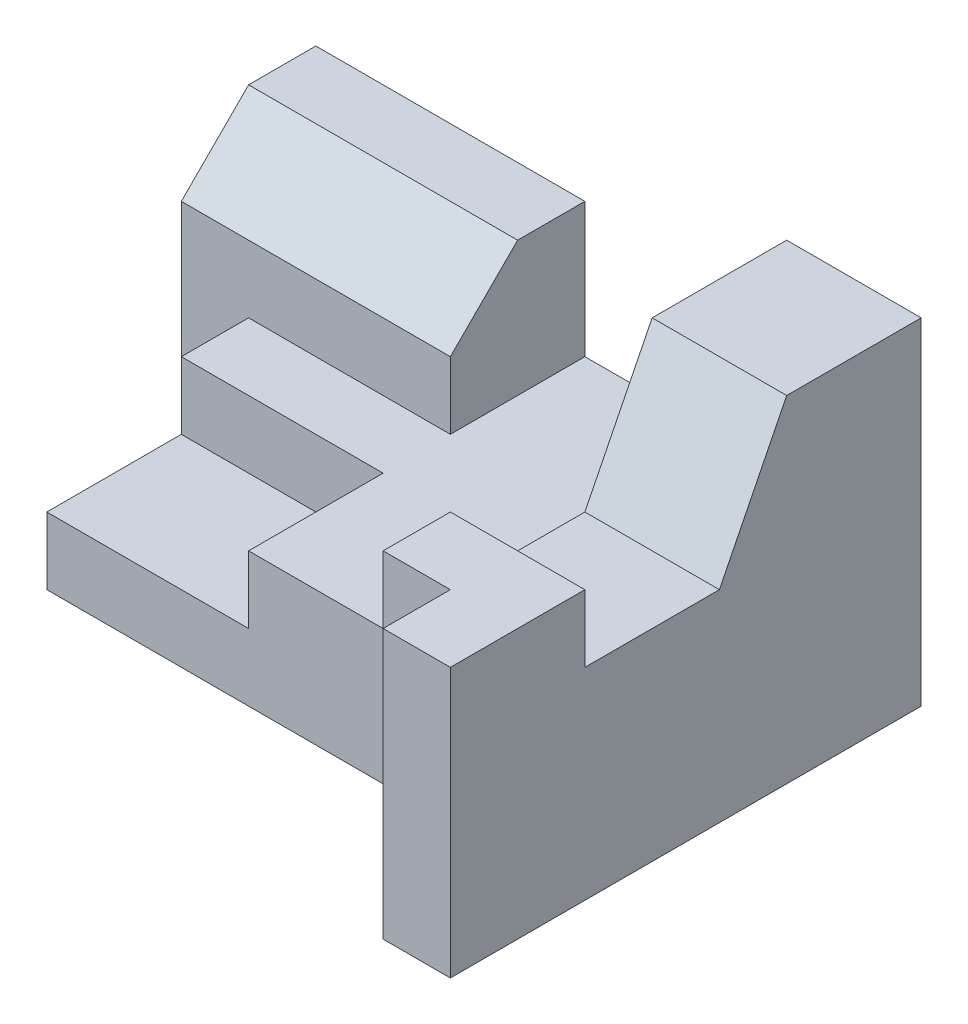
ISO-10303-21;
HEADER;
FILE_DESCRIPTION(('STEP AP214'),'2;1');
FILE_NAME('part.step','',(''),(''),'','','');
FILE_SCHEMA(('AUTOMOTIVE_DESIGN { 1 0 10303 214 1 1 1 1 }'));
ENDSEC;
DATA;
#1=APPLICATION_CONTEXT('core data for automotive mechanical design processes');
#2=APPLICATION_PROTOCOL_DEFINITION('international standard','automotive_design',2000,#1);
#3=PRODUCT_CONTEXT('',#1,'mechanical');
#4=PRODUCT('Part','Part','',(#3));
#5=PRODUCT_RELATED_PRODUCT_CATEGORY('part','',(#4));
#6=PRODUCT_DEFINITION_FORMATION('','',#4);
#7=PRODUCT_DEFINITION_CONTEXT('part definition',#1,'design');
#8=PRODUCT_DEFINITION('design','',#6,#7);
#9=PRODUCT_DEFINITION_SHAPE('','',#8);
#10=(LENGTH_UNIT() NAMED_UNIT(*) SI_UNIT(.MILLI.,.METRE.));
#11=(NAMED_UNIT(*) PLANE_ANGLE_UNIT() SI_UNIT($,.RADIAN.));
#12=(NAMED_UNIT(*) SI_UNIT($,.STERADIAN.) SOLID_ANGLE_UNIT());
#13=UNCERTAINTY_MEASURE_WITH_UNIT(LENGTH_MEASURE(1.E-05),#10,'distance_accuracy_value','');
#14=(GEOMETRIC_REPRESENTATION_CONTEXT(3) GLOBAL_UNCERTAINTY_ASSIGNED_CONTEXT((#13)) GLOBAL_UNIT_ASSIGNED_CONTEXT((#10,
#11,#12)) REPRESENTATION_CONTEXT('',''));
#15=CARTESIAN_POINT('',(0.,0.,0.));
#16=DIRECTION('',(0.,0.,1.));
#17=DIRECTION('',(1.,0.,0.));
#18=AXIS2_PLACEMENT_3D('',#15,#16,#17);
#19=CARTESIAN_POINT('',(-3.,2.,2.5));
#20=DIRECTION('',(1.,0.,0.));
#21=DIRECTION('',(0.,0.,-1.));
#22=AXIS2_PLACEMENT_3D('',#19,#20,#21);
#23=PLANE('',#22);
#24=DIRECTION('',(0.,0.,1.));
#25=VECTOR('',#24,1.);
#26=CARTESIAN_POINT('',(-3.,1.,2.5));
#27=LINE('',#26,#25);
#28=CARTESIAN_POINT('',(-3.,1.,0.5));
#29=VERTEX_POINT('',#28);
#30=CARTESIAN_POINT('',(-3.,1.,2.5));
#31=VERTEX_POINT('',#30);
#32=EDGE_CURVE('E48',#29,#31,#27,.T.);
#33=ORIENTED_EDGE('',*,*,#32,.F.);
#34=DIRECTION('',(0.,1.,0.));
#35=VECTOR('',#34,1.);
#36=CARTESIAN_POINT('',(-3.,1.,0.5));
#37=LINE('',#36,#35);
#38=CARTESIAN_POINT('',(-3.,2.,0.5));
#39=VERTEX_POINT('',#38);
#40=EDGE_CURVE('E198',#29,#39,#37,.T.);
#41=ORIENTED_EDGE('',*,*,#40,.T.);
#42=DIRECTION('',(0.,0.,1.));
#43=VECTOR('',#42,1.);
#44=CARTESIAN_POINT('',(-3.,2.,2.5));
#45=LINE('',#44,#43);
#46=CARTESIAN_POINT('',(-3.,2.,-0.5));
#47=VERTEX_POINT('',#46);
#48=EDGE_CURVE('E305',#47,#39,#45,.T.);
#49=ORIENTED_EDGE('',*,*,#48,.F.);
#50=DIRECTION('',(0.,1.,0.));
#51=VECTOR('',#50,1.);
#52=CARTESIAN_POINT('',(-3.,2.,-0.5));
#53=LINE('',#52,#51);
#54=CARTESIAN_POINT('',(-3.,0.,-0.5));
#55=VERTEX_POINT('',#54);
#56=EDGE_CURVE('E298',#55,#47,#53,.T.);
#57=ORIENTED_EDGE('',*,*,#56,.F.);
#58=DIRECTION('',(0.,0.,1.));
#59=VECTOR('',#58,1.);
#60=CARTESIAN_POINT('',(-3.,0.,2.5));
#61=LINE('',#60,#59);
#62=CARTESIAN_POINT('',(-3.,0.,2.5));
#63=VERTEX_POINT('',#62);
#64=EDGE_CURVE('E312',#55,#63,#61,.T.);
#65=ORIENTED_EDGE('',*,*,#64,.T.);
#66=DIRECTION('',(0.,-1.,0.));
#67=VECTOR('',#66,1.);
#68=CARTESIAN_POINT('',(-3.,2.,2.5));
#69=LINE('',#68,#67);
#70=EDGE_CURVE('E318',#31,#63,#69,.T.);
#71=ORIENTED_EDGE('',*,*,#70,.F.);
#72=EDGE_LOOP('',(#33,#41,#49,#57,#65,#71));
#73=FACE_BOUND('',#72,.T.);
#74=ADVANCED_FACE('F33',(#73),#23,.F.);
#75=CARTESIAN_POINT('',(0.,2.,0.));
#76=DIRECTION('',(0.,-1.,0.));
#77=DIRECTION('',(0.,0.,-1.));
#78=AXIS2_PLACEMENT_3D('',#75,#76,#77);
#79=PLANE('',#78);
#80=ORIENTED_EDGE('',*,*,#48,.T.);
#81=DIRECTION('',(-1.,0.,0.));
#82=VECTOR('',#81,1.);
#83=CARTESIAN_POINT('',(-3.,2.,0.5));
#84=LINE('',#83,#82);
#85=CARTESIAN_POINT('',(0.,2.,0.5));
#86=VERTEX_POINT('',#85);
#87=EDGE_CURVE('E420',#86,#39,#84,.T.);
#88=ORIENTED_EDGE('',*,*,#87,.F.);
#89=DIRECTION('',(0.,0.,-1.));
#90=VECTOR('',#89,1.);
#91=CARTESIAN_POINT('',(0.,2.,2.5));
#92=LINE('',#91,#90);
#93=CARTESIAN_POINT('',(0.,2.,2.5));
#94=VERTEX_POINT('',#93);
#95=EDGE_CURVE('E389',#94,#86,#92,.T.);
#96=ORIENTED_EDGE('',*,*,#95,.F.);
#97=DIRECTION('',(1.,0.,0.));
#98=VECTOR('',#97,1.);
#99=CARTESIAN_POINT('',(-3.,2.,2.5));
#100=LINE('',#99,#98);
#101=CARTESIAN_POINT('',(3.,2.,2.5));
#102=VERTEX_POINT('',#101);
#103=EDGE_CURVE('E196',#94,#102,#100,.T.);
#104=ORIENTED_EDGE('',*,*,#103,.T.);
#105=DIRECTION('',(0.,0.,-1.));
#106=VECTOR('',#105,1.);
#107=CARTESIAN_POINT('',(3.,2.,2.5));
#108=LINE('',#107,#106);
#109=CARTESIAN_POINT('',(3.,2.,-2.5));
#110=VERTEX_POINT('',#109);
#111=EDGE_CURVE('E327',#102,#110,#108,.T.);
#112=ORIENTED_EDGE('',*,*,#111,.T.);
#113=DIRECTION('',(-1.,0.,0.));
#114=VECTOR('',#113,1.);
#115=CARTESIAN_POINT('',(-3.,2.,-2.5));
#116=LINE('',#115,#114);
#117=CARTESIAN_POINT('',(0.,2.,-2.5));
#118=VERTEX_POINT('',#117);
#119=EDGE_CURVE('E308',#110,#118,#116,.T.);
#120=ORIENTED_EDGE('',*,*,#119,.T.);
#121=DIRECTION('',(0.,0.,-1.));
#122=VECTOR('',#121,1.);
#123=CARTESIAN_POINT('',(0.,2.,0.));
#124=LINE('',#123,#122);
#125=CARTESIAN_POINT('',(0.,2.,-0.5));
#126=VERTEX_POINT('',#125);
#127=EDGE_CURVE('E301',#126,#118,#124,.T.);
#128=ORIENTED_EDGE('',*,*,#127,.F.);
#129=DIRECTION('',(1.,0.,0.));
#130=VECTOR('',#129,1.);
#131=CARTESIAN_POINT('',(0.,2.,-0.5));
#132=LINE('',#131,#130);
#133=EDGE_CURVE('E295',#47,#126,#132,.T.);
#134=ORIENTED_EDGE('',*,*,#133,.F.);
#135=EDGE_LOOP('',(#80,#88,#96,#104,#112,#120,#128,#134));
#136=FACE_BOUND('',#135,.T.);
#137=ADVANCED_FACE('F386',(#136),#79,.F.);
#138=CARTESIAN_POINT('',(-3.,2.,-2.5));
#139=DIRECTION('',(0.,0.,1.));
#140=DIRECTION('',(1.,0.,0.));
#141=AXIS2_PLACEMENT_3D('',#138,#139,#140);
#142=PLANE('',#141);
#143=DIRECTION('',(-1.,0.,0.));
#144=VECTOR('',#143,1.);
#145=CARTESIAN_POINT('',(-3.,0.,-2.5));
#146=LINE('',#145,#144);
#147=CARTESIAN_POINT('',(5.,0.,-2.5));
#148=VERTEX_POINT('',#147);
#149=CARTESIAN_POINT('',(-4.,0.,-2.5));
#150=VERTEX_POINT('',#149);
#151=EDGE_CURVE('E304',#148,#150,#146,.T.);
#152=ORIENTED_EDGE('',*,*,#151,.T.);
#153=DIRECTION('',(0.,-1.,0.));
#154=VECTOR('',#153,1.);
#155=CARTESIAN_POINT('',(-4.,4.,-2.5));
#156=LINE('',#155,#154);
#157=CARTESIAN_POINT('',(-4.,4.,-2.5));
#158=VERTEX_POINT('',#157);
#159=EDGE_CURVE('E290',#158,#150,#156,.T.);
#160=ORIENTED_EDGE('',*,*,#159,.F.);
#161=DIRECTION('',(-1.,0.,0.));
#162=VECTOR('',#161,1.);
#163=CARTESIAN_POINT('',(0.,4.,-2.5));
#164=LINE('',#163,#162);
#165=CARTESIAN_POINT('',(0.,4.,-2.5));
#166=VERTEX_POINT('',#165);
#167=EDGE_CURVE('E415',#166,#158,#164,.T.);
#168=ORIENTED_EDGE('',*,*,#167,.F.);
#169=DIRECTION('',(0.,-1.,0.));
#170=VECTOR('',#169,1.);
#171=CARTESIAN_POINT('',(0.,4.,-2.5));
#172=LINE('',#171,#170);
#173=EDGE_CURVE('E292',#166,#118,#172,.T.);
#174=ORIENTED_EDGE('',*,*,#173,.T.);
#175=ORIENTED_EDGE('',*,*,#119,.F.);
#176=DIRECTION('',(0.,-1.,0.));
#177=VECTOR('',#176,1.);
#178=CARTESIAN_POINT('',(3.,5.,-2.5));
#179=LINE('',#178,#177);
#180=CARTESIAN_POINT('',(3.,5.,-2.5));
#181=VERTEX_POINT('',#180);
#182=EDGE_CURVE('E239',#181,#110,#179,.T.);
#183=ORIENTED_EDGE('',*,*,#182,.F.);
#184=DIRECTION('',(-1.,0.,0.));
#185=VECTOR('',#184,1.);
#186=CARTESIAN_POINT('',(3.,5.,-2.5));
#187=LINE('',#186,#185);
#188=CARTESIAN_POINT('',(5.,5.,-2.5));
#189=VERTEX_POINT('',#188);
#190=EDGE_CURVE('E237',#189,#181,#187,.T.);
#191=ORIENTED_EDGE('',*,*,#190,.F.);
#192=DIRECTION('',(0.,-1.,0.));
#193=VECTOR('',#192,1.);
#194=CARTESIAN_POINT('',(5.,5.,-2.5));
#195=LINE('',#194,#193);
#196=EDGE_CURVE('E253',#189,#148,#195,.T.);
#197=ORIENTED_EDGE('',*,*,#196,.T.);
#198=EDGE_LOOP('',(#152,#160,#168,#174,#175,#183,#191,#197));
#199=FACE_BOUND('',#198,.T.);
#200=ADVANCED_FACE('F377',(#199),#142,.F.);
#201=CARTESIAN_POINT('',(-3.,2.,2.5));
#202=DIRECTION('',(0.,0.,-1.));
#203=DIRECTION('',(-1.,0.,0.));
#204=AXIS2_PLACEMENT_3D('',#201,#202,#203);
#205=PLANE('',#204);
#206=ORIENTED_EDGE('',*,*,#103,.F.);
#207=DIRECTION('',(0.,1.,0.));
#208=VECTOR('',#207,1.);
#209=CARTESIAN_POINT('',(0.,1.,2.5));
#210=LINE('',#209,#208);
#211=CARTESIAN_POINT('',(0.,1.,2.5));
#212=VERTEX_POINT('',#211);
#213=EDGE_CURVE('E182',#212,#94,#210,.T.);
#214=ORIENTED_EDGE('',*,*,#213,.F.);
#215=DIRECTION('',(1.,0.,0.));
#216=VECTOR('',#215,1.);
#217=CARTESIAN_POINT('',(-3.,1.,2.5));
#218=LINE('',#217,#216);
#219=EDGE_CURVE('E187',#31,#212,#218,.T.);
#220=ORIENTED_EDGE('',*,*,#219,.F.);
#221=ORIENTED_EDGE('',*,*,#70,.T.);
#222=DIRECTION('',(1.,0.,0.));
#223=VECTOR('',#222,1.);
#224=CARTESIAN_POINT('',(-3.,0.,2.5));
#225=LINE('',#224,#223);
#226=CARTESIAN_POINT('',(3.,0.,2.5));
#227=VERTEX_POINT('',#226);
#228=EDGE_CURVE('E315',#63,#227,#225,.T.);
#229=ORIENTED_EDGE('',*,*,#228,.T.);
#230=DIRECTION('',(0.,-1.,0.));
#231=VECTOR('',#230,1.);
#232=CARTESIAN_POINT('',(3.,2.,2.5));
#233=LINE('',#232,#231);
#234=EDGE_CURVE('E310',#102,#227,#233,.T.);
#235=ORIENTED_EDGE('',*,*,#234,.F.);
#236=EDGE_LOOP('',(#206,#214,#220,#221,#229,#235));
#237=FACE_BOUND('',#236,.T.);
#238=ADVANCED_FACE('F194',(#237),#205,.F.);
#239=CARTESIAN_POINT('',(0.,0.,0.));
#240=DIRECTION('',(0.,-1.,0.));
#241=DIRECTION('',(0.,0.,-1.));
#242=AXIS2_PLACEMENT_3D('',#239,#240,#241);
#243=PLANE('',#242);
#244=DIRECTION('',(0.,0.,1.));
#245=VECTOR('',#244,1.);
#246=CARTESIAN_POINT('',(-4.,0.,-2.5));
#247=LINE('',#246,#245);
#248=CARTESIAN_POINT('',(-4.,0.,-0.5));
#249=VERTEX_POINT('',#248);
#250=EDGE_CURVE('E270',#150,#249,#247,.T.);
#251=ORIENTED_EDGE('',*,*,#250,.F.);
#252=ORIENTED_EDGE('',*,*,#151,.F.);
#253=DIRECTION('',(0.,0.,-1.));
#254=VECTOR('',#253,1.);
#255=CARTESIAN_POINT('',(5.,0.,-2.5));
#256=LINE('',#255,#254);
#257=CARTESIAN_POINT('',(5.,0.,4.5));
#258=VERTEX_POINT('',#257);
#259=EDGE_CURVE('E235',#258,#148,#256,.T.);
#260=ORIENTED_EDGE('',*,*,#259,.F.);
#261=DIRECTION('',(1.,0.,0.));
#262=VECTOR('',#261,1.);
#263=CARTESIAN_POINT('',(5.,0.,4.5));
#264=LINE('',#263,#262);
#265=CARTESIAN_POINT('',(4.,0.,4.5));
#266=VERTEX_POINT('',#265);
#267=EDGE_CURVE('E369',#266,#258,#264,.T.);
#268=ORIENTED_EDGE('',*,*,#267,.F.);
#269=DIRECTION('',(0.,0.,1.));
#270=VECTOR('',#269,1.);
#271=CARTESIAN_POINT('',(4.,0.,4.5));
#272=LINE('',#271,#270);
#273=CARTESIAN_POINT('',(4.,0.,3.5));
#274=VERTEX_POINT('',#273);
#275=EDGE_CURVE('E364',#274,#266,#272,.T.);
#276=ORIENTED_EDGE('',*,*,#275,.F.);
#277=DIRECTION('',(1.,0.,0.));
#278=VECTOR('',#277,1.);
#279=CARTESIAN_POINT('',(4.,0.,3.5));
#280=LINE('',#279,#278);
#281=CARTESIAN_POINT('',(3.,0.,3.5));
#282=VERTEX_POINT('',#281);
#283=EDGE_CURVE('E242',#282,#274,#280,.T.);
#284=ORIENTED_EDGE('',*,*,#283,.F.);
#285=DIRECTION('',(0.,0.,1.));
#286=VECTOR('',#285,1.);
#287=CARTESIAN_POINT('',(3.,0.,3.5));
#288=LINE('',#287,#286);
#289=EDGE_CURVE('E230',#227,#282,#288,.T.);
#290=ORIENTED_EDGE('',*,*,#289,.F.);
#291=ORIENTED_EDGE('',*,*,#228,.F.);
#292=ORIENTED_EDGE('',*,*,#64,.F.);
#293=DIRECTION('',(1.,0.,0.));
#294=VECTOR('',#293,1.);
#295=CARTESIAN_POINT('',(0.,0.,-0.5));
#296=LINE('',#295,#294);
#297=EDGE_CURVE('E274',#249,#55,#296,.T.);
#298=ORIENTED_EDGE('',*,*,#297,.F.);
#299=EDGE_LOOP('',(#251,#252,#260,#268,#276,#284,#290,#291,#292,#298));
#300=FACE_BOUND('',#299,.T.);
#301=ADVANCED_FACE('F366',(#300),#243,.T.);
#302=CARTESIAN_POINT('',(0.,4.,-2.5));
#303=DIRECTION('',(-1.,0.,0.));
#304=DIRECTION('',(0.,0.,1.));
#305=AXIS2_PLACEMENT_3D('',#302,#303,#304);
#306=PLANE('',#305);
#307=DIRECTION('',(0.,0.,-1.));
#308=VECTOR('',#307,1.);
#309=CARTESIAN_POINT('',(0.,4.,-2.5));
#310=LINE('',#309,#308);
#311=CARTESIAN_POINT('',(0.,4.,-1.5));
#312=VERTEX_POINT('',#311);
#313=EDGE_CURVE('E254',#312,#166,#310,.T.);
#314=ORIENTED_EDGE('',*,*,#313,.F.);
#315=DIRECTION('',(0.,0.707106781186548,-0.707106781186548));
#316=VECTOR('',#315,1.);
#317=CARTESIAN_POINT('',(0.,4.,-1.5));
#318=LINE('',#317,#316);
#319=CARTESIAN_POINT('',(0.,3.,-0.5));
#320=VERTEX_POINT('',#319);
#321=EDGE_CURVE('E406',#312,#320,#318,.F.);
#322=ORIENTED_EDGE('',*,*,#321,.T.);
#323=DIRECTION('',(0.,-1.,0.));
#324=VECTOR('',#323,1.);
#325=CARTESIAN_POINT('',(0.,4.,-0.5));
#326=LINE('',#325,#324);
#327=EDGE_CURVE('E286',#320,#126,#326,.T.);
#328=ORIENTED_EDGE('',*,*,#327,.T.);
#329=ORIENTED_EDGE('',*,*,#127,.T.);
#330=ORIENTED_EDGE('',*,*,#173,.F.);
#331=EDGE_LOOP('',(#314,#322,#328,#329,#330));
#332=FACE_BOUND('',#331,.T.);
#333=ADVANCED_FACE('F414',(#332),#306,.F.);
#334=CARTESIAN_POINT('',(0.,4.,-0.5));
#335=DIRECTION('',(0.,0.,-1.));
#336=DIRECTION('',(-1.,0.,0.));
#337=AXIS2_PLACEMENT_3D('',#334,#335,#336);
#338=PLANE('',#337);
#339=ORIENTED_EDGE('',*,*,#327,.F.);
#340=DIRECTION('',(-1.,0.,0.));
#341=VECTOR('',#340,1.);
#342=CARTESIAN_POINT('',(0.,3.,-0.5));
#343=LINE('',#342,#341);
#344=CARTESIAN_POINT('',(-4.,3.,-0.5));
#345=VERTEX_POINT('',#344);
#346=EDGE_CURVE('E397',#320,#345,#343,.T.);
#347=ORIENTED_EDGE('',*,*,#346,.T.);
#348=DIRECTION('',(0.,-1.,0.));
#349=VECTOR('',#348,1.);
#350=CARTESIAN_POINT('',(-4.,4.,-0.5));
#351=LINE('',#350,#349);
#352=EDGE_CURVE('E288',#345,#249,#351,.T.);
#353=ORIENTED_EDGE('',*,*,#352,.T.);
#354=ORIENTED_EDGE('',*,*,#297,.T.);
#355=ORIENTED_EDGE('',*,*,#56,.T.);
#356=ORIENTED_EDGE('',*,*,#133,.T.);
#357=EDGE_LOOP('',(#339,#347,#353,#354,#355,#356));
#358=FACE_BOUND('',#357,.T.);
#359=ADVANCED_FACE('F395',(#358),#338,.F.);
#360=CARTESIAN_POINT('',(-4.,4.,-2.5));
#361=DIRECTION('',(1.,0.,0.));
#362=DIRECTION('',(0.,0.,-1.));
#363=AXIS2_PLACEMENT_3D('',#360,#361,#362);
#364=PLANE('',#363);
#365=ORIENTED_EDGE('',*,*,#352,.F.);
#366=DIRECTION('',(0.,-0.707106781186548,0.707106781186548));
#367=VECTOR('',#366,1.);
#368=CARTESIAN_POINT('',(-4.,4.,-1.5));
#369=LINE('',#368,#367);
#370=CARTESIAN_POINT('',(-4.,4.,-1.5));
#371=VERTEX_POINT('',#370);
#372=EDGE_CURVE('E324',#345,#371,#369,.F.);
#373=ORIENTED_EDGE('',*,*,#372,.T.);
#374=DIRECTION('',(0.,0.,1.));
#375=VECTOR('',#374,1.);
#376=CARTESIAN_POINT('',(-4.,4.,-2.5));
#377=LINE('',#376,#375);
#378=EDGE_CURVE('E284',#158,#371,#377,.T.);
#379=ORIENTED_EDGE('',*,*,#378,.F.);
#380=ORIENTED_EDGE('',*,*,#159,.T.);
#381=ORIENTED_EDGE('',*,*,#250,.T.);
#382=EDGE_LOOP('',(#365,#373,#379,#380,#381));
#383=FACE_BOUND('',#382,.T.);
#384=ADVANCED_FACE('F399',(#383),#364,.F.);
#385=CARTESIAN_POINT('',(0.,4.,0.));
#386=DIRECTION('',(0.,-1.,0.));
#387=DIRECTION('',(0.,0.,-1.));
#388=AXIS2_PLACEMENT_3D('',#385,#386,#387);
#389=PLANE('',#388);
#390=ORIENTED_EDGE('',*,*,#378,.T.);
#391=DIRECTION('',(1.,0.,0.));
#392=VECTOR('',#391,1.);
#393=CARTESIAN_POINT('',(0.,4.,-1.5));
#394=LINE('',#393,#392);
#395=EDGE_CURVE('E405',#371,#312,#394,.T.);
#396=ORIENTED_EDGE('',*,*,#395,.T.);
#397=ORIENTED_EDGE('',*,*,#313,.T.);
#398=ORIENTED_EDGE('',*,*,#167,.T.);
#399=EDGE_LOOP('',(#390,#396,#397,#398));
#400=FACE_BOUND('',#399,.T.);
#401=ADVANCED_FACE('F410',(#400),#389,.F.);
#402=CARTESIAN_POINT('',(0.,4.,-1.5));
#403=DIRECTION('',(0.,-0.707106781186548,-0.707106781186548));
#404=DIRECTION('',(1.,0.,0.));
#405=AXIS2_PLACEMENT_3D('',#402,#403,#404);
#406=PLANE('',#405);
#407=ORIENTED_EDGE('',*,*,#372,.F.);
#408=ORIENTED_EDGE('',*,*,#346,.F.);
#409=ORIENTED_EDGE('',*,*,#321,.F.);
#410=ORIENTED_EDGE('',*,*,#395,.F.);
#411=EDGE_LOOP('',(#407,#408,#409,#410));
#412=FACE_BOUND('',#411,.T.);
#413=ADVANCED_FACE('F35',(#412),#406,.F.);
#414=CARTESIAN_POINT('',(3.,5.,3.5));
#415=DIRECTION('',(1.,0.,0.));
#416=DIRECTION('',(0.,0.,-1.));
#417=AXIS2_PLACEMENT_3D('',#414,#415,#416);
#418=PLANE('',#417);
#419=DIRECTION('',(0.,-1.,0.));
#420=VECTOR('',#419,1.);
#421=CARTESIAN_POINT('',(3.,5.,3.5));
#422=LINE('',#421,#420);
#423=CARTESIAN_POINT('',(3.,4.,3.5));
#424=VERTEX_POINT('',#423);
#425=EDGE_CURVE('E248',#424,#282,#422,.T.);
#426=ORIENTED_EDGE('',*,*,#425,.F.);
#427=DIRECTION('',(0.,0.,1.));
#428=VECTOR('',#427,1.);
#429=CARTESIAN_POINT('',(3.,4.,2.5));
#430=LINE('',#429,#428);
#431=CARTESIAN_POINT('',(3.,4.,2.5));
#432=VERTEX_POINT('',#431);
#433=EDGE_CURVE('E212',#432,#424,#430,.T.);
#434=ORIENTED_EDGE('',*,*,#433,.F.);
#435=DIRECTION('',(0.,1.,0.));
#436=VECTOR('',#435,1.);
#437=CARTESIAN_POINT('',(3.,3.,2.5));
#438=LINE('',#437,#436);
#439=CARTESIAN_POINT('',(3.,3.,2.5));
#440=VERTEX_POINT('',#439);
#441=EDGE_CURVE('E209',#440,#432,#438,.T.);
#442=ORIENTED_EDGE('',*,*,#441,.F.);
#443=DIRECTION('',(0.,0.,1.));
#444=VECTOR('',#443,1.);
#445=CARTESIAN_POINT('',(3.,3.,0.5));
#446=LINE('',#445,#444);
#447=CARTESIAN_POINT('',(3.,3.,0.5));
#448=VERTEX_POINT('',#447);
#449=EDGE_CURVE('E206',#448,#440,#446,.T.);
#450=ORIENTED_EDGE('',*,*,#449,.F.);
#451=DIRECTION('',(0.,-0.894427190999916,0.447213595499958));
#452=VECTOR('',#451,1.);
#453=CARTESIAN_POINT('',(3.,5.,-0.5));
#454=LINE('',#453,#452);
#455=CARTESIAN_POINT('',(3.,5.,-0.5));
#456=VERTEX_POINT('',#455);
#457=EDGE_CURVE('E203',#456,#448,#454,.T.);
#458=ORIENTED_EDGE('',*,*,#457,.F.);
#459=DIRECTION('',(0.,0.,1.));
#460=VECTOR('',#459,1.);
#461=CARTESIAN_POINT('',(3.,5.,3.5));
#462=LINE('',#461,#460);
#463=EDGE_CURVE('E231',#181,#456,#462,.T.);
#464=ORIENTED_EDGE('',*,*,#463,.F.);
#465=ORIENTED_EDGE('',*,*,#182,.T.);
#466=ORIENTED_EDGE('',*,*,#111,.F.);
#467=ORIENTED_EDGE('',*,*,#234,.T.);
#468=ORIENTED_EDGE('',*,*,#289,.T.);
#469=EDGE_LOOP('',(#426,#434,#442,#450,#458,#464,#465,#466,#467,#468));
#470=FACE_BOUND('',#469,.T.);
#471=ADVANCED_FACE('F356',(#470),#418,.F.);
#472=CARTESIAN_POINT('',(4.,5.,3.5));
#473=DIRECTION('',(0.,0.,-1.));
#474=DIRECTION('',(-1.,0.,0.));
#475=AXIS2_PLACEMENT_3D('',#472,#473,#474);
#476=PLANE('',#475);
#477=DIRECTION('',(0.,-1.,0.));
#478=VECTOR('',#477,1.);
#479=CARTESIAN_POINT('',(4.,5.,3.5));
#480=LINE('',#479,#478);
#481=CARTESIAN_POINT('',(4.,4.,3.5));
#482=VERTEX_POINT('',#481);
#483=EDGE_CURVE('E265',#482,#274,#480,.T.);
#484=ORIENTED_EDGE('',*,*,#483,.F.);
#485=DIRECTION('',(-1.,0.,0.));
#486=VECTOR('',#485,1.);
#487=CARTESIAN_POINT('',(4.,4.,3.5));
#488=LINE('',#487,#486);
#489=EDGE_CURVE('E227',#482,#424,#488,.T.);
#490=ORIENTED_EDGE('',*,*,#489,.T.);
#491=ORIENTED_EDGE('',*,*,#425,.T.);
#492=ORIENTED_EDGE('',*,*,#283,.T.);
#493=EDGE_LOOP('',(#484,#490,#491,#492));
#494=FACE_BOUND('',#493,.T.);
#495=ADVANCED_FACE('F359',(#494),#476,.F.);
#496=CARTESIAN_POINT('',(4.,5.,4.5));
#497=DIRECTION('',(1.,0.,0.));
#498=DIRECTION('',(0.,0.,-1.));
#499=AXIS2_PLACEMENT_3D('',#496,#497,#498);
#500=PLANE('',#499);
#501=DIRECTION('',(0.,-1.,0.));
#502=VECTOR('',#501,1.);
#503=CARTESIAN_POINT('',(4.,5.,4.5));
#504=LINE('',#503,#502);
#505=CARTESIAN_POINT('',(4.,4.,4.5));
#506=VERTEX_POINT('',#505);
#507=EDGE_CURVE('E264',#506,#266,#504,.T.);
#508=ORIENTED_EDGE('',*,*,#507,.F.);
#509=DIRECTION('',(0.,0.,-1.));
#510=VECTOR('',#509,1.);
#511=CARTESIAN_POINT('',(4.,4.,4.5));
#512=LINE('',#511,#510);
#513=EDGE_CURVE('E224',#506,#482,#512,.T.);
#514=ORIENTED_EDGE('',*,*,#513,.T.);
#515=ORIENTED_EDGE('',*,*,#483,.T.);
#516=ORIENTED_EDGE('',*,*,#275,.T.);
#517=EDGE_LOOP('',(#508,#514,#515,#516));
#518=FACE_BOUND('',#517,.T.);
#519=ADVANCED_FACE('F463',(#518),#500,.F.);
#520=CARTESIAN_POINT('',(5.,5.,4.5));
#521=DIRECTION('',(0.,0.,-1.));
#522=DIRECTION('',(-1.,0.,0.));
#523=AXIS2_PLACEMENT_3D('',#520,#521,#522);
#524=PLANE('',#523);
#525=DIRECTION('',(0.,-1.,0.));
#526=VECTOR('',#525,1.);
#527=CARTESIAN_POINT('',(5.,5.,4.5));
#528=LINE('',#527,#526);
#529=CARTESIAN_POINT('',(5.,4.,4.5));
#530=VERTEX_POINT('',#529);
#531=EDGE_CURVE('E262',#530,#258,#528,.T.);
#532=ORIENTED_EDGE('',*,*,#531,.F.);
#533=DIRECTION('',(-1.,0.,0.));
#534=VECTOR('',#533,1.);
#535=CARTESIAN_POINT('',(5.,4.,4.5));
#536=LINE('',#535,#534);
#537=EDGE_CURVE('E221',#530,#506,#536,.T.);
#538=ORIENTED_EDGE('',*,*,#537,.T.);
#539=ORIENTED_EDGE('',*,*,#507,.T.);
#540=ORIENTED_EDGE('',*,*,#267,.T.);
#541=EDGE_LOOP('',(#532,#538,#539,#540));
#542=FACE_BOUND('',#541,.T.);
#543=ADVANCED_FACE('F466',(#542),#524,.F.);
#544=CARTESIAN_POINT('',(5.,5.,-2.5));
#545=DIRECTION('',(-1.,0.,0.));
#546=DIRECTION('',(0.,0.,1.));
#547=AXIS2_PLACEMENT_3D('',#544,#545,#546);
#548=PLANE('',#547);
#549=DIRECTION('',(0.,1.,0.));
#550=VECTOR('',#549,1.);
#551=CARTESIAN_POINT('',(5.,5.,2.5));
#552=LINE('',#551,#550);
#553=CARTESIAN_POINT('',(5.,3.,2.5));
#554=VERTEX_POINT('',#553);
#555=CARTESIAN_POINT('',(5.,4.,2.5));
#556=VERTEX_POINT('',#555);
#557=EDGE_CURVE('E41',#554,#556,#552,.T.);
#558=ORIENTED_EDGE('',*,*,#557,.T.);
#559=DIRECTION('',(0.,0.,1.));
#560=VECTOR('',#559,1.);
#561=CARTESIAN_POINT('',(5.,4.,-2.5));
#562=LINE('',#561,#560);
#563=EDGE_CURVE('E11',#556,#530,#562,.T.);
#564=ORIENTED_EDGE('',*,*,#563,.T.);
#565=ORIENTED_EDGE('',*,*,#531,.T.);
#566=ORIENTED_EDGE('',*,*,#259,.T.);
#567=ORIENTED_EDGE('',*,*,#196,.F.);
#568=DIRECTION('',(0.,0.,-1.));
#569=VECTOR('',#568,1.);
#570=CARTESIAN_POINT('',(5.,5.,-2.5));
#571=LINE('',#570,#569);
#572=CARTESIAN_POINT('',(5.,5.,-0.5));
#573=VERTEX_POINT('',#572);
#574=EDGE_CURVE('E234',#573,#189,#571,.T.);
#575=ORIENTED_EDGE('',*,*,#574,.F.);
#576=DIRECTION('',(0.,-0.894427190999916,0.447213595499958));
#577=VECTOR('',#576,1.);
#578=CARTESIAN_POINT('',(5.,5.8,-0.9));
#579=LINE('',#578,#577);
#580=CARTESIAN_POINT('',(5.,3.,0.5));
#581=VERTEX_POINT('',#580);
#582=EDGE_CURVE('E56',#573,#581,#579,.T.);
#583=ORIENTED_EDGE('',*,*,#582,.T.);
#584=DIRECTION('',(0.,0.,1.));
#585=VECTOR('',#584,1.);
#586=CARTESIAN_POINT('',(5.,3.,-2.5));
#587=LINE('',#586,#585);
#588=EDGE_CURVE('E339',#581,#554,#587,.T.);
#589=ORIENTED_EDGE('',*,*,#588,.T.);
#590=EDGE_LOOP('',(#558,#564,#565,#566,#567,#575,#583,#589));
#591=FACE_BOUND('',#590,.T.);
#592=ADVANCED_FACE('F343',(#591),#548,.F.);
#593=CARTESIAN_POINT('',(0.,5.,0.));
#594=DIRECTION('',(0.,-1.,0.));
#595=DIRECTION('',(0.,0.,-1.));
#596=AXIS2_PLACEMENT_3D('',#593,#594,#595);
#597=PLANE('',#596);
#598=ORIENTED_EDGE('',*,*,#463,.T.);
#599=DIRECTION('',(1.,0.,0.));
#600=VECTOR('',#599,1.);
#601=CARTESIAN_POINT('',(0.,5.,-0.5));
#602=LINE('',#601,#600);
#603=EDGE_CURVE('E337',#456,#573,#602,.T.);
#604=ORIENTED_EDGE('',*,*,#603,.T.);
#605=ORIENTED_EDGE('',*,*,#574,.T.);
#606=ORIENTED_EDGE('',*,*,#190,.T.);
#607=EDGE_LOOP('',(#598,#604,#605,#606));
#608=FACE_BOUND('',#607,.T.);
#609=ADVANCED_FACE('F382',(#608),#597,.F.);
#610=CARTESIAN_POINT('',(8.,4.,2.5));
#611=DIRECTION('',(0.,-1.,0.));
#612=DIRECTION('',(0.,0.,-1.));
#613=AXIS2_PLACEMENT_3D('',#610,#611,#612);
#614=PLANE('',#613);
#615=ORIENTED_EDGE('',*,*,#513,.F.);
#616=ORIENTED_EDGE('',*,*,#537,.F.);
#617=ORIENTED_EDGE('',*,*,#563,.F.);
#618=DIRECTION('',(-1.,0.,0.));
#619=VECTOR('',#618,1.);
#620=CARTESIAN_POINT('',(8.,4.,2.5));
#621=LINE('',#620,#619);
#622=EDGE_CURVE('E215',#556,#432,#621,.T.);
#623=ORIENTED_EDGE('',*,*,#622,.T.);
#624=ORIENTED_EDGE('',*,*,#433,.T.);
#625=ORIENTED_EDGE('',*,*,#489,.F.);
#626=EDGE_LOOP('',(#615,#616,#617,#623,#624,#625));
#627=FACE_BOUND('',#626,.T.);
#628=ADVANCED_FACE('F358',(#627),#614,.F.);
#629=CARTESIAN_POINT('',(8.,3.,2.5));
#630=DIRECTION('',(0.,0.,1.));
#631=DIRECTION('',(1.,0.,0.));
#632=AXIS2_PLACEMENT_3D('',#629,#630,#631);
#633=PLANE('',#632);
#634=DIRECTION('',(-1.,0.,0.));
#635=VECTOR('',#634,1.);
#636=CARTESIAN_POINT('',(8.,3.,2.5));
#637=LINE('',#636,#635);
#638=EDGE_CURVE('E217',#554,#440,#637,.T.);
#639=ORIENTED_EDGE('',*,*,#638,.T.);
#640=ORIENTED_EDGE('',*,*,#441,.T.);
#641=ORIENTED_EDGE('',*,*,#622,.F.);
#642=ORIENTED_EDGE('',*,*,#557,.F.);
#643=EDGE_LOOP('',(#639,#640,#641,#642));
#644=FACE_BOUND('',#643,.T.);
#645=ADVANCED_FACE('F348',(#644),#633,.F.);
#646=CARTESIAN_POINT('',(8.,3.,0.5));
#647=DIRECTION('',(0.,-1.,0.));
#648=DIRECTION('',(0.,0.,-1.));
#649=AXIS2_PLACEMENT_3D('',#646,#647,#648);
#650=PLANE('',#649);
#651=DIRECTION('',(-1.,0.,0.));
#652=VECTOR('',#651,1.);
#653=CARTESIAN_POINT('',(8.,3.,0.5));
#654=LINE('',#653,#652);
#655=EDGE_CURVE('E214',#581,#448,#654,.T.);
#656=ORIENTED_EDGE('',*,*,#655,.T.);
#657=ORIENTED_EDGE('',*,*,#449,.T.);
#658=ORIENTED_EDGE('',*,*,#638,.F.);
#659=ORIENTED_EDGE('',*,*,#588,.F.);
#660=EDGE_LOOP('',(#656,#657,#658,#659));
#661=FACE_BOUND('',#660,.T.);
#662=ADVANCED_FACE('F350',(#661),#650,.F.);
#663=CARTESIAN_POINT('',(8.,5.,-0.5));
#664=DIRECTION('',(0.,-0.447213595499958,-0.894427190999916));
#665=DIRECTION('',(0.,0.894427190999916,-0.447213595499958));
#666=AXIS2_PLACEMENT_3D('',#663,#664,#665);
#667=PLANE('',#666);
#668=ORIENTED_EDGE('',*,*,#603,.F.);
#669=ORIENTED_EDGE('',*,*,#457,.T.);
#670=ORIENTED_EDGE('',*,*,#655,.F.);
#671=ORIENTED_EDGE('',*,*,#582,.F.);
#672=EDGE_LOOP('',(#668,#669,#670,#671));
#673=FACE_BOUND('',#672,.T.);
#674=ADVANCED_FACE('F383',(#673),#667,.F.);
#675=CARTESIAN_POINT('',(-3.,1.,0.5));
#676=DIRECTION('',(0.,0.,-1.));
#677=DIRECTION('',(-1.,0.,0.));
#678=AXIS2_PLACEMENT_3D('',#675,#676,#677);
#679=PLANE('',#678);
#680=ORIENTED_EDGE('',*,*,#87,.T.);
#681=ORIENTED_EDGE('',*,*,#40,.F.);
#682=DIRECTION('',(-1.,0.,0.));
#683=VECTOR('',#682,1.);
#684=CARTESIAN_POINT('',(-3.,1.,0.5));
#685=LINE('',#684,#683);
#686=CARTESIAN_POINT('',(0.,1.,0.5));
#687=VERTEX_POINT('',#686);
#688=EDGE_CURVE('E186',#687,#29,#685,.T.);
#689=ORIENTED_EDGE('',*,*,#688,.F.);
#690=DIRECTION('',(0.,1.,0.));
#691=VECTOR('',#690,1.);
#692=CARTESIAN_POINT('',(0.,1.,0.5));
#693=LINE('',#692,#691);
#694=EDGE_CURVE('E184',#687,#86,#693,.T.);
#695=ORIENTED_EDGE('',*,*,#694,.T.);
#696=EDGE_LOOP('',(#680,#681,#689,#695));
#697=FACE_BOUND('',#696,.T.);
#698=ADVANCED_FACE('F423',(#697),#679,.F.);
#699=CARTESIAN_POINT('',(0.,1.,2.5));
#700=DIRECTION('',(1.,0.,0.));
#701=DIRECTION('',(0.,0.,-1.));
#702=AXIS2_PLACEMENT_3D('',#699,#700,#701);
#703=PLANE('',#702);
#704=ORIENTED_EDGE('',*,*,#95,.T.);
#705=ORIENTED_EDGE('',*,*,#694,.F.);
#706=DIRECTION('',(0.,0.,-1.));
#707=VECTOR('',#706,1.);
#708=CARTESIAN_POINT('',(0.,1.,2.5));
#709=LINE('',#708,#707);
#710=EDGE_CURVE('E178',#212,#687,#709,.T.);
#711=ORIENTED_EDGE('',*,*,#710,.F.);
#712=ORIENTED_EDGE('',*,*,#213,.T.);
#713=EDGE_LOOP('',(#704,#705,#711,#712));
#714=FACE_BOUND('',#713,.T.);
#715=ADVANCED_FACE('F180',(#714),#703,.F.);
#716=CARTESIAN_POINT('',(0.,1.,0.));
#717=DIRECTION('',(0.,-1.,0.));
#718=DIRECTION('',(0.,0.,-1.));
#719=AXIS2_PLACEMENT_3D('',#716,#717,#718);
#720=PLANE('',#719);
#721=ORIENTED_EDGE('',*,*,#32,.T.);
#722=ORIENTED_EDGE('',*,*,#219,.T.);
#723=ORIENTED_EDGE('',*,*,#710,.T.);
#724=ORIENTED_EDGE('',*,*,#688,.T.);
#725=EDGE_LOOP('',(#721,#722,#723,#724));
#726=FACE_BOUND('',#725,.T.);
#727=ADVANCED_FACE('F189',(#726),#720,.F.);
#728=CLOSED_SHELL('',(#74,#137,#200,#238,#301,#333,#359,#384,#401,#413,#471,#495,#519,#543,#592,
#609,#628,#645,#662,#674,#698,#715,#727));
#729=MANIFOLD_SOLID_BREP('B2',#728);
#730=ADVANCED_BREP_SHAPE_REPRESENTATION('',(#18,#729),#14);
#731=SHAPE_DEFINITION_REPRESENTATION(#9,#730);
ENDSEC;
END-ISO-10303-21;
